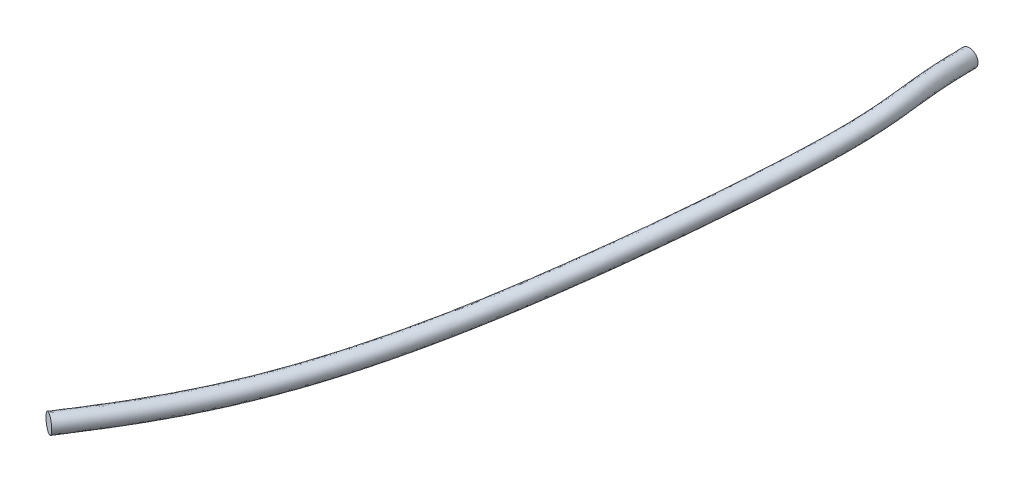
ISO-10303-21;
HEADER;
FILE_DESCRIPTION(('STEP AP214'),'2;1');
FILE_NAME('part.step','',(''),(''),'','','');
FILE_SCHEMA(('AUTOMOTIVE_DESIGN { 1 0 10303 214 1 1 1 1 }'));
ENDSEC;
DATA;
#1=APPLICATION_CONTEXT('core data for automotive mechanical design processes');
#2=APPLICATION_PROTOCOL_DEFINITION('international standard','automotive_design',2000,#1);
#3=PRODUCT_CONTEXT('',#1,'mechanical');
#4=PRODUCT('Part','Part','',(#3));
#5=PRODUCT_RELATED_PRODUCT_CATEGORY('part','',(#4));
#6=PRODUCT_DEFINITION_FORMATION('','',#4);
#7=PRODUCT_DEFINITION_CONTEXT('part definition',#1,'design');
#8=PRODUCT_DEFINITION('design','',#6,#7);
#9=PRODUCT_DEFINITION_SHAPE('','',#8);
#10=(LENGTH_UNIT() NAMED_UNIT(*) SI_UNIT(.MILLI.,.METRE.));
#11=(NAMED_UNIT(*) PLANE_ANGLE_UNIT() SI_UNIT($,.RADIAN.));
#12=(NAMED_UNIT(*) SI_UNIT($,.STERADIAN.) SOLID_ANGLE_UNIT());
#13=UNCERTAINTY_MEASURE_WITH_UNIT(LENGTH_MEASURE(1.E-05),#10,'distance_accuracy_value','');
#14=(GEOMETRIC_REPRESENTATION_CONTEXT(3) GLOBAL_UNCERTAINTY_ASSIGNED_CONTEXT((#13)) GLOBAL_UNIT_ASSIGNED_CONTEXT((#10,
#11,#12)) REPRESENTATION_CONTEXT('',''));
#15=CARTESIAN_POINT('',(0.,0.,0.));
#16=DIRECTION('',(0.,0.,1.));
#17=DIRECTION('',(1.,0.,0.));
#18=AXIS2_PLACEMENT_3D('',#15,#16,#17);
#19=CARTESIAN_POINT('',(0.,0.,0.));
#20=DIRECTION('',(0.,0.,1.));
#21=DIRECTION('',(1.,0.,0.));
#22=AXIS2_PLACEMENT_3D('',#19,#20,#21);
#23=PLANE('',#22);
#24=CARTESIAN_POINT('',(0.,0.,0.));
#25=DIRECTION('',(0.,0.,-1.));
#26=DIRECTION('',(1.,0.,0.));
#27=AXIS2_PLACEMENT_3D('',#24,#25,#26);
#28=CIRCLE('',#27,1.15);
#29=CARTESIAN_POINT('',(1.15,0.,0.));
#30=VERTEX_POINT('',#29);
#31=EDGE_CURVE('E44',#30,#30,#28,.T.);
#32=ORIENTED_EDGE('',*,*,#31,.T.);
#33=EDGE_LOOP('',(#32));
#34=FACE_BOUND('',#33,.T.);
#35=ADVANCED_FACE('F37',(#34),#23,.F.);
#36=CARTESIAN_POINT('',(-40.1891861869022,-21.1190555910862,82.0495406097306));
#37=DIRECTION('',(-0.523066911051622,0.0173189381133083,0.852115638247264));
#38=DIRECTION('',(0.839482303165105,-0.162216449648336,0.518608991568888));
#39=AXIS2_PLACEMENT_3D('',#36,#37,#38);
#40=PLANE('',#39);
#41=CARTESIAN_POINT('',(-40.1891861869022,-21.1190555910862,82.0495406097306));
#42=DIRECTION('',(0.523066911051622,-0.0173189381133083,-0.852115638247264));
#43=DIRECTION('',(0.839482303165105,-0.162216449648336,0.518608991568888));
#44=AXIS2_PLACEMENT_3D('',#41,#42,#43);
#45=CIRCLE('',#44,1.15);
#46=CARTESIAN_POINT('',(-39.2237815382624,-21.3056045081818,82.6459409500348));
#47=VERTEX_POINT('',#46);
#48=EDGE_CURVE('E11',#47,#47,#45,.T.);
#49=ORIENTED_EDGE('',*,*,#48,.F.);
#50=EDGE_LOOP('',(#49));
#51=FACE_BOUND('',#50,.T.);
#52=ADVANCED_FACE('F54',(#51),#40,.T.);
#53=CARTESIAN_POINT('',(1.15,0.,0.));
#54=CARTESIAN_POINT('',(1.15000000144366,7.20211161642477E-10,1.95143650964167));
#55=CARTESIAN_POINT('',(1.20622590283796,-0.0180084902922004,3.51269738991182));
#56=CARTESIAN_POINT('',(1.28013739089192,-0.168570841201481,6.23684377893701));
#57=CARTESIAN_POINT('',(1.29893429024295,-0.301479833944161,7.4050627006684));
#58=CARTESIAN_POINT('',(1.12787614204195,-0.77873712711421,9.69393493904792));
#59=CARTESIAN_POINT('',(0.934272869510342,-1.12474594820879,10.8074515445958));
#60=CARTESIAN_POINT('',(0.189155180938306,-2.07661842014926,13.2272806110371));
#61=CARTESIAN_POINT('',(-0.358717878546888,-2.67981038190878,14.5346246022732));
#62=CARTESIAN_POINT('',(-2.40118231195554,-4.64877181739815,18.6085088504666));
#63=CARTESIAN_POINT('',(-4.25852590368728,-6.25441666013519,21.7817112451415));
#64=CARTESIAN_POINT('',(-8.39487169455971,-9.60212919484409,28.7242194629464));
#65=CARTESIAN_POINT('',(-10.6722892268256,-11.3418492196251,32.4883301998899));
#66=CARTESIAN_POINT('',(-16.1943113291562,-15.2182645999995,42.1629616253261));
#67=CARTESIAN_POINT('',(-19.1049742099855,-16.873554675777,47.8851708296531));
#68=CARTESIAN_POINT('',(-28.6572772561788,-21.2475742907675,65.8311498474764));
#69=CARTESIAN_POINT('',(-33.8674574316434,-21.4829543743858,73.920083058212));
#70=CARTESIAN_POINT('',(-39.2237815382624,-21.3056045081818,82.6459409500348));
#71=CARTESIAN_POINT('',(1.15,-2.3,0.));
#72=CARTESIAN_POINT('',(1.15000000151191,-2.29999999930247,1.93691349664838));
#73=CARTESIAN_POINT('',(1.20537180512164,-2.31877394118791,3.4630667389245));
#74=CARTESIAN_POINT('',(1.27510401661552,-2.46080010755252,6.03277211417422));
#75=CARTESIAN_POINT('',(1.2905443755972,-2.5820393650124,7.07456933034643));
#76=CARTESIAN_POINT('',(1.14042405579988,-3.00135239054872,9.08559952774971));
#77=CARTESIAN_POINT('',(0.97423162480966,-3.30269506927493,10.0637658770454));
#78=CARTESIAN_POINT('',(0.278860773719742,-4.19112213316196,12.3223196141851));
#79=CARTESIAN_POINT('',(-0.25096579911246,-4.7767658894762,13.5957672941097));
#80=CARTESIAN_POINT('',(-2.27549681623206,-6.72843932638967,17.6338817739762));
#81=CARTESIAN_POINT('',(-4.13761803841304,-8.33919031609541,20.8174997321641));
#82=CARTESIAN_POINT('',(-8.29719603013418,-11.7057115446228,27.799014343803));
#83=CARTESIAN_POINT('',(-10.5938352821385,-13.4607890788969,31.5942556798542));
#84=CARTESIAN_POINT('',(-16.2076410470252,-17.4016358585136,41.4296928960429));
#85=CARTESIAN_POINT('',(-19.1633728120616,-19.0815695694952,47.2405885551904));
#86=CARTESIAN_POINT('',(-28.8224850791944,-23.5044973280292,65.3872307231536));
#87=CARTESIAN_POINT('',(-34.1725827128342,-23.7532494545851,73.7038663408957));
#88=CARTESIAN_POINT('',(-39.5623620785418,-23.5747918723732,82.4842253851126));
#89=CARTESIAN_POINT('',(-1.15,-2.3,0.));
#90=CARTESIAN_POINT('',(-1.14999999844743,-2.29999999931797,1.98109375578373));
#91=CARTESIAN_POINT('',(-1.09335271378284,-2.32014159454708,3.54127108178073));
#92=CARTESIAN_POINT('',(-1.02448064835617,-2.46042654646795,6.07927407132188));
#93=CARTESIAN_POINT('',(-1.01339852772852,-2.57784666356256,7.04467796065394));
#94=CARTESIAN_POINT('',(-1.14336948493598,-2.94110196114834,8.7860650291266));
#95=CARTESIAN_POINT('',(-1.27755783968144,-3.18688499862361,9.58525494220966));
#96=CARTESIAN_POINT('',(-1.88948260265174,-3.96878723043885,11.5727899771709));
#97=CARTESIAN_POINT('',(-2.3751498583266,-4.50880916555192,12.7521322882529));
#98=CARTESIAN_POINT('',(-4.31976401325525,-6.38344177870962,16.6308451806631));
#99=CARTESIAN_POINT('',(-6.16831964141897,-7.98490835475729,19.79722648169));
#100=CARTESIAN_POINT('',(-10.3137992430629,-11.3400256325171,26.7550758832065));
#101=CARTESIAN_POINT('',(-12.6130750402747,-13.0976789708543,30.5542788450679));
#102=CARTESIAN_POINT('',(-18.260532088173,-17.062148684274,40.4486734052187));
#103=CARTESIAN_POINT('',(-21.2238227033499,-18.7439525252159,46.2750110932025));
#104=CARTESIAN_POINT('',(-30.8136418586378,-23.1351507839293,64.2914718171081));
#105=CARTESIAN_POINT('',(-36.0923743904975,-23.380516417844,72.4931171229209));
#106=CARTESIAN_POINT('',(-41.4931713758216,-23.201694038182,81.2914247045041));
#107=CARTESIAN_POINT('',(-1.15,0.,0.));
#108=CARTESIAN_POINT('',(-1.14999999851569,7.04714786313529E-10,1.99561676877702));
#109=CARTESIAN_POINT('',(-1.09249861606652,-0.0193761436513657,3.59090173276806));
#110=CARTESIAN_POINT('',(-1.01944727407976,-0.168197280116911,6.28334573608467));
#111=CARTESIAN_POINT('',(-1.00500861308276,-0.297287132494317,7.37517133097591));
#112=CARTESIAN_POINT('',(-1.15591739869391,-0.718486697713824,9.39440044042481));
#113=CARTESIAN_POINT('',(-1.31751659498076,-1.00893587755733,10.3289406097601));
#114=CARTESIAN_POINT('',(-1.97918819543318,-1.85428351742629,12.4777509740229));
#115=CARTESIAN_POINT('',(-2.48290193776103,-2.4118536579845,13.690989596414));
#116=CARTESIAN_POINT('',(-4.44544950897873,-4.30377426971809,17.6054722571574));
#117=CARTESIAN_POINT('',(-6.28922750669226,-5.90013469879612,20.7614379946674));
#118=CARTESIAN_POINT('',(-10.4114749074894,-9.23644328273934,27.6802810023499));
#119=CARTESIAN_POINT('',(-12.6915289849599,-10.9787391115826,31.4483533651036));
#120=CARTESIAN_POINT('',(-18.2472023703073,-14.8787774257598,41.181942134502));
#121=CARTESIAN_POINT('',(-21.1654241012737,-16.5359376315027,46.9195933676652));
#122=CARTESIAN_POINT('',(-30.6484340356222,-20.8782277466547,64.7353909414309));
#123=CARTESIAN_POINT('',(-35.7872491093066,-21.1102213376447,72.7093338402372));
#124=CARTESIAN_POINT('',(-41.1545908355421,-20.9325066739906,81.4531402694264));
#125=CARTESIAN_POINT('',(-1.15,2.3,0.));
#126=CARTESIAN_POINT('',(-1.14999999858395,2.3000000007274,2.01013978177032));
#127=CARTESIAN_POINT('',(-1.09164451835021,2.28138930724435,3.64053238375538));
#128=CARTESIAN_POINT('',(-1.01441389980336,2.12403198623413,6.48741740084747));
#129=CARTESIAN_POINT('',(-0.99661869843701,1.98327239857393,7.70566470129788));
#130=CARTESIAN_POINT('',(-1.16846531245183,1.50412856572069,10.002735851723));
#131=CARTESIAN_POINT('',(-1.35747535028008,1.16901324350895,11.0726262773105));
#132=CARTESIAN_POINT('',(-2.06889378821462,0.260220195586268,13.3827119708749));
#133=CARTESIAN_POINT('',(-2.59065401719546,-0.314898150417083,14.629846904575));
#134=CARTESIAN_POINT('',(-4.57113500470221,-2.22410676072657,18.5800993336516));
#135=CARTESIAN_POINT('',(-6.41013537196555,-3.81536104283495,21.7256495076448));
#136=CARTESIAN_POINT('',(-10.5091505719158,-7.1328609329616,28.6054861214933));
#137=CARTESIAN_POINT('',(-12.7699829296452,-8.85979925231079,32.3424278851393));
#138=CARTESIAN_POINT('',(-18.2338726524415,-12.6954061672456,41.9152108637853));
#139=CARTESIAN_POINT('',(-21.1070254991976,-14.3279227377894,47.5641756421279));
#140=CARTESIAN_POINT('',(-30.4832262126066,-18.6213047093801,65.1793100657537));
#141=CARTESIAN_POINT('',(-35.4821238281157,-18.8399262574453,72.9255505575534));
#142=CARTESIAN_POINT('',(-40.8160102952627,-18.6633193097992,81.6148558343486));
#143=CARTESIAN_POINT('',(1.15,2.3,0.));
#144=CARTESIAN_POINT('',(1.1500000013754,2.30000000074289,1.96595952263497));
#145=CARTESIAN_POINT('',(1.20708000055428,2.28275696060351,3.56232804089915));
#146=CARTESIAN_POINT('',(1.28517076516832,2.12365842514956,6.44091544369981));
#147=CARTESIAN_POINT('',(1.3073242048887,1.97907969712408,7.73555607099037));
#148=CARTESIAN_POINT('',(1.11532822828403,1.4438781363203,10.3022703503461));
#149=CARTESIAN_POINT('',(0.894314114211023,1.05320317285736,11.5511372121463));
#150=CARTESIAN_POINT('',(0.0994495881568704,0.0378852928634389,14.1322416078891));
#151=CARTESIAN_POINT('',(-0.466469957981315,-0.582854874341361,15.4734819104367));
#152=CARTESIAN_POINT('',(-2.52686780767902,-2.56910430840662,19.583135926957));
#153=CARTESIAN_POINT('',(-4.37943376896151,-4.16964300417496,22.7459227581189));
#154=CARTESIAN_POINT('',(-8.49254735898525,-7.4985468450654,29.6494245820898));
#155=CARTESIAN_POINT('',(-10.7507431715128,-9.22290936035332,33.3824047199256));
#156=CARTESIAN_POINT('',(-16.1809816112873,-13.0348933414853,42.8962303546094));
#157=CARTESIAN_POINT('',(-19.0465756079094,-14.6655397820587,48.5297531041157));
#158=CARTESIAN_POINT('',(-28.4920694331632,-18.9906512535058,66.2750689717992));
#159=CARTESIAN_POINT('',(-33.5623321504525,-19.2126592941865,74.1362997755283));
#160=CARTESIAN_POINT('',(-38.8852009979829,-19.0364171439904,82.807656514957));
#161=CARTESIAN_POINT('',(1.15,0.,0.));
#162=CARTESIAN_POINT('',(1.15000000144366,7.20211161642477E-10,1.95143650964167));
#163=CARTESIAN_POINT('',(1.20622590283796,-0.0180084902922004,3.51269738991182));
#164=CARTESIAN_POINT('',(1.28013739089192,-0.168570841201481,6.23684377893701));
#165=CARTESIAN_POINT('',(1.29893429024295,-0.301479833944161,7.4050627006684));
#166=CARTESIAN_POINT('',(1.12787614204195,-0.77873712711421,9.69393493904792));
#167=CARTESIAN_POINT('',(0.934272869510342,-1.12474594820879,10.8074515445958));
#168=CARTESIAN_POINT('',(0.189155180938306,-2.07661842014926,13.2272806110371));
#169=CARTESIAN_POINT('',(-0.358717878546888,-2.67981038190878,14.5346246022732));
#170=CARTESIAN_POINT('',(-2.40118231195554,-4.64877181739815,18.6085088504666));
#171=CARTESIAN_POINT('',(-4.25852590368728,-6.25441666013519,21.7817112451415));
#172=CARTESIAN_POINT('',(-8.39487169455971,-9.60212919484409,28.7242194629464));
#173=CARTESIAN_POINT('',(-10.6722892268256,-11.3418492196251,32.4883301998899));
#174=CARTESIAN_POINT('',(-16.1943113291562,-15.2182645999995,42.1629616253261));
#175=CARTESIAN_POINT('',(-19.1049742099855,-16.873554675777,47.8851708296531));
#176=CARTESIAN_POINT('',(-28.6572772561788,-21.2475742907675,65.8311498474764));
#177=CARTESIAN_POINT('',(-33.8674574316434,-21.4829543743858,73.920083058212));
#178=CARTESIAN_POINT('',(-39.2237815382624,-21.3056045081818,82.6459409500348));
#179=(BOUNDED_SURFACE() B_SPLINE_SURFACE(3,3,((#53,#54,#55,#56,#57,#58,#59,#60,#61,#62,#63,#64,
#65,#66,#67,#68,#69,#70),(#71,#72,#73,#74,#75,#76,#77,#78,#79,#80,#81,#82,#83,#84,#85,#86,#87,
#88),(#89,#90,#91,#92,#93,#94,#95,#96,#97,#98,#99,#100,#101,#102,#103,#104,#105,#106),(#107,
#108,#109,#110,#111,#112,#113,#114,#115,#116,#117,#118,#119,#120,#121,#122,#123,#124),(#125,
#126,#127,#128,#129,#130,#131,#132,#133,#134,#135,#136,#137,#138,#139,#140,#141,#142),(#143,
#144,#145,#146,#147,#148,#149,#150,#151,#152,#153,#154,#155,#156,#157,#158,#159,#160),(#161,
#162,#163,#164,#165,#166,#167,#168,#169,#170,#171,#172,#173,#174,#175,#176,#177,#178)),
.UNSPECIFIED.,.T.,.F.,.F.) B_SPLINE_SURFACE_WITH_KNOTS((4,3,4),(4,2,2,2,2,2,2,2,4),(0.,0.5,1.),
(0.,0.0605175553157011,0.121035110631402,0.181552665947103,0.242070221262805,0.337545074726631,
0.433019928190457,0.591544001721442,1.),
.UNSPECIFIED.) GEOMETRIC_REPRESENTATION_ITEM() RATIONAL_B_SPLINE_SURFACE(((1.,1.,1.,1.,1.,1.,1.,
1.,1.,1.,1.,1.,1.,1.,1.,1.,1.,1.),(0.333333333333333,0.333333333333333,0.333333333333333,
0.333333333333333,0.333333333333333,0.333333333333333,0.333333333333333,0.333333333333333,
0.333333333333333,0.333333333333333,0.333333333333333,0.333333333333333,0.333333333333333,
0.333333333333333,0.333333333333333,0.333333333333333,0.333333333333333,0.333333333333333),
(0.333333333333333,0.333333333333333,0.333333333333333,0.333333333333333,0.333333333333333,
0.333333333333333,0.333333333333333,0.333333333333333,0.333333333333333,0.333333333333333,
0.333333333333333,0.333333333333333,0.333333333333333,0.333333333333333,0.333333333333333,
0.333333333333333,0.333333333333333,0.333333333333333),(1.,1.,1.,1.,1.,1.,1.,1.,1.,1.,1.,1.,1.,
1.,1.,1.,1.,1.),(0.333333333333333,0.333333333333333,0.333333333333333,0.333333333333333,
0.333333333333333,0.333333333333333,0.333333333333333,0.333333333333333,0.333333333333333,
0.333333333333333,0.333333333333333,0.333333333333333,0.333333333333333,0.333333333333333,
0.333333333333333,0.333333333333333,0.333333333333333,0.333333333333333),(0.333333333333333,
0.333333333333333,0.333333333333333,0.333333333333333,0.333333333333333,0.333333333333333,
0.333333333333333,0.333333333333333,0.333333333333333,0.333333333333333,0.333333333333333,
0.333333333333333,0.333333333333333,0.333333333333333,0.333333333333333,0.333333333333333,
0.333333333333333,0.333333333333333),(1.,1.,1.,1.,1.,1.,1.,1.,1.,1.,1.,1.,1.,1.,1.,1.,1.,1.))) REPRESENTATION_ITEM('') SURFACE());
#180=ORIENTED_EDGE('',*,*,#48,.T.);
#181=EDGE_LOOP('',(#180));
#182=FACE_BOUND('',#181,.T.);
#183=ORIENTED_EDGE('',*,*,#31,.F.);
#184=EDGE_LOOP('',(#183));
#185=FACE_BOUND('',#184,.T.);
#186=ADVANCED_FACE('F51',(#182,#185),#179,.F.);
#187=CLOSED_SHELL('',(#35,#52,#186));
#188=MANIFOLD_SOLID_BREP('B2',#187);
#189=ADVANCED_BREP_SHAPE_REPRESENTATION('',(#18,#188),#14);
#190=SHAPE_DEFINITION_REPRESENTATION(#9,#189);
ENDSEC;
END-ISO-10303-21;
